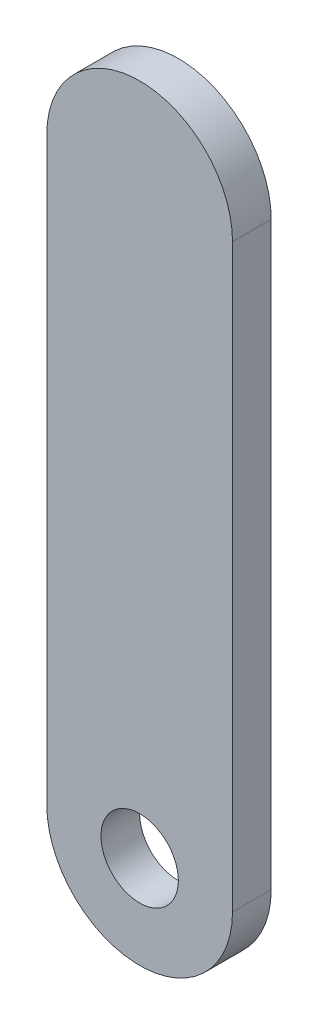
ISO-10303-21;
HEADER;
FILE_DESCRIPTION(('STEP AP214'),'2;1');
FILE_NAME('part.step','',(''),(''),'','','');
FILE_SCHEMA(('AUTOMOTIVE_DESIGN { 1 0 10303 214 1 1 1 1 }'));
ENDSEC;
DATA;
#1=APPLICATION_CONTEXT('core data for automotive mechanical design processes');
#2=APPLICATION_PROTOCOL_DEFINITION('international standard','automotive_design',2000,#1);
#3=PRODUCT_CONTEXT('',#1,'mechanical');
#4=PRODUCT('Part','Part','',(#3));
#5=PRODUCT_RELATED_PRODUCT_CATEGORY('part','',(#4));
#6=PRODUCT_DEFINITION_FORMATION('','',#4);
#7=PRODUCT_DEFINITION_CONTEXT('part definition',#1,'design');
#8=PRODUCT_DEFINITION('design','',#6,#7);
#9=PRODUCT_DEFINITION_SHAPE('','',#8);
#10=(LENGTH_UNIT() NAMED_UNIT(*) SI_UNIT(.MILLI.,.METRE.));
#11=(NAMED_UNIT(*) PLANE_ANGLE_UNIT() SI_UNIT($,.RADIAN.));
#12=(NAMED_UNIT(*) SI_UNIT($,.STERADIAN.) SOLID_ANGLE_UNIT());
#13=UNCERTAINTY_MEASURE_WITH_UNIT(LENGTH_MEASURE(1.E-05),#10,'distance_accuracy_value','');
#14=(GEOMETRIC_REPRESENTATION_CONTEXT(3) GLOBAL_UNCERTAINTY_ASSIGNED_CONTEXT((#13)) GLOBAL_UNIT_ASSIGNED_CONTEXT((#10,
#11,#12)) REPRESENTATION_CONTEXT('',''));
#15=CARTESIAN_POINT('',(0.,0.,0.));
#16=DIRECTION('',(0.,0.,1.));
#17=DIRECTION('',(1.,0.,0.));
#18=AXIS2_PLACEMENT_3D('',#15,#16,#17);
#19=CARTESIAN_POINT('',(0.,0.,5.));
#20=DIRECTION('',(0.,0.,1.));
#21=DIRECTION('',(1.,0.,0.));
#22=AXIS2_PLACEMENT_3D('',#19,#20,#21);
#23=PLANE('',#22);
#24=CARTESIAN_POINT('',(0.,0.,5.));
#25=DIRECTION('',(0.,0.,1.));
#26=DIRECTION('',(1.,0.,0.));
#27=AXIS2_PLACEMENT_3D('',#24,#25,#26);
#28=CIRCLE('',#27,12.);
#29=CARTESIAN_POINT('',(-12.,0.,5.));
#30=VERTEX_POINT('',#29);
#31=CARTESIAN_POINT('',(12.,0.,5.));
#32=VERTEX_POINT('',#31);
#33=EDGE_CURVE('E85',#30,#32,#28,.T.);
#34=ORIENTED_EDGE('',*,*,#33,.T.);
#35=DIRECTION('',(0.,1.,0.));
#36=VECTOR('',#35,1.);
#37=CARTESIAN_POINT('',(12.,0.,5.));
#38=LINE('',#37,#36);
#39=CARTESIAN_POINT('',(12.,75.,5.));
#40=VERTEX_POINT('',#39);
#41=EDGE_CURVE('E80',#32,#40,#38,.T.);
#42=ORIENTED_EDGE('',*,*,#41,.T.);
#43=CARTESIAN_POINT('',(0.,75.,5.));
#44=DIRECTION('',(0.,0.,1.));
#45=DIRECTION('',(1.,0.,0.));
#46=AXIS2_PLACEMENT_3D('',#43,#44,#45);
#47=CIRCLE('',#46,12.);
#48=CARTESIAN_POINT('',(-12.,75.,5.));
#49=VERTEX_POINT('',#48);
#50=EDGE_CURVE('E83',#40,#49,#47,.T.);
#51=ORIENTED_EDGE('',*,*,#50,.T.);
#52=DIRECTION('',(0.,-1.,0.));
#53=VECTOR('',#52,1.);
#54=CARTESIAN_POINT('',(-12.,0.,5.));
#55=LINE('',#54,#53);
#56=EDGE_CURVE('E50',#49,#30,#55,.T.);
#57=ORIENTED_EDGE('',*,*,#56,.T.);
#58=EDGE_LOOP('',(#34,#42,#51,#57));
#59=FACE_BOUND('',#58,.T.);
#60=CARTESIAN_POINT('',(0.,0.,5.));
#61=DIRECTION('',(0.,0.,1.));
#62=DIRECTION('',(1.,0.,0.));
#63=AXIS2_PLACEMENT_3D('',#60,#61,#62);
#64=CIRCLE('',#63,5.);
#65=CARTESIAN_POINT('',(5.,0.,5.));
#66=VERTEX_POINT('',#65);
#67=EDGE_CURVE('E100',#66,#66,#64,.T.);
#68=ORIENTED_EDGE('',*,*,#67,.F.);
#69=EDGE_LOOP('',(#68));
#70=FACE_BOUND('',#69,.T.);
#71=ADVANCED_FACE('F33',(#59,#70),#23,.T.);
#72=CARTESIAN_POINT('',(0.,0.,0.));
#73=DIRECTION('',(0.,0.,1.));
#74=DIRECTION('',(1.,0.,0.));
#75=AXIS2_PLACEMENT_3D('',#72,#73,#74);
#76=PLANE('',#75);
#77=CARTESIAN_POINT('',(0.,0.,0.));
#78=DIRECTION('',(0.,0.,1.));
#79=DIRECTION('',(1.,0.,0.));
#80=AXIS2_PLACEMENT_3D('',#77,#78,#79);
#81=CIRCLE('',#80,12.);
#82=CARTESIAN_POINT('',(-12.,0.,0.));
#83=VERTEX_POINT('',#82);
#84=CARTESIAN_POINT('',(12.,0.,0.));
#85=VERTEX_POINT('',#84);
#86=EDGE_CURVE('E97',#83,#85,#81,.T.);
#87=ORIENTED_EDGE('',*,*,#86,.F.);
#88=DIRECTION('',(0.,-1.,0.));
#89=VECTOR('',#88,1.);
#90=CARTESIAN_POINT('',(-12.,0.,0.));
#91=LINE('',#90,#89);
#92=CARTESIAN_POINT('',(-12.,75.,0.));
#93=VERTEX_POINT('',#92);
#94=EDGE_CURVE('E73',#93,#83,#91,.T.);
#95=ORIENTED_EDGE('',*,*,#94,.F.);
#96=CARTESIAN_POINT('',(0.,75.,0.));
#97=DIRECTION('',(0.,0.,1.));
#98=DIRECTION('',(1.,0.,0.));
#99=AXIS2_PLACEMENT_3D('',#96,#97,#98);
#100=CIRCLE('',#99,12.);
#101=CARTESIAN_POINT('',(12.,75.,0.));
#102=VERTEX_POINT('',#101);
#103=EDGE_CURVE('E67',#102,#93,#100,.T.);
#104=ORIENTED_EDGE('',*,*,#103,.F.);
#105=DIRECTION('',(0.,1.,0.));
#106=VECTOR('',#105,1.);
#107=CARTESIAN_POINT('',(12.,0.,0.));
#108=LINE('',#107,#106);
#109=EDGE_CURVE('E89',#85,#102,#108,.T.);
#110=ORIENTED_EDGE('',*,*,#109,.F.);
#111=EDGE_LOOP('',(#87,#95,#104,#110));
#112=FACE_BOUND('',#111,.T.);
#113=CARTESIAN_POINT('',(0.,0.,0.));
#114=DIRECTION('',(0.,0.,1.));
#115=DIRECTION('',(1.,0.,0.));
#116=AXIS2_PLACEMENT_3D('',#113,#114,#115);
#117=CIRCLE('',#116,5.);
#118=CARTESIAN_POINT('',(5.,0.,0.));
#119=VERTEX_POINT('',#118);
#120=EDGE_CURVE('E112',#119,#119,#117,.T.);
#121=ORIENTED_EDGE('',*,*,#120,.T.);
#122=EDGE_LOOP('',(#121));
#123=FACE_BOUND('',#122,.T.);
#124=ADVANCED_FACE('F108',(#112,#123),#76,.F.);
#125=CARTESIAN_POINT('',(0.,0.,5.));
#126=DIRECTION('',(0.,0.,-1.));
#127=DIRECTION('',(-1.,0.,0.));
#128=AXIS2_PLACEMENT_3D('',#125,#126,#127);
#129=CYLINDRICAL_SURFACE('',#128,12.);
#130=ORIENTED_EDGE('',*,*,#86,.T.);
#131=DIRECTION('',(0.,0.,-1.));
#132=VECTOR('',#131,1.);
#133=CARTESIAN_POINT('',(12.,0.,5.));
#134=LINE('',#133,#132);
#135=EDGE_CURVE('E11',#32,#85,#134,.T.);
#136=ORIENTED_EDGE('',*,*,#135,.F.);
#137=ORIENTED_EDGE('',*,*,#33,.F.);
#138=DIRECTION('',(0.,0.,-1.));
#139=VECTOR('',#138,1.);
#140=CARTESIAN_POINT('',(-12.,0.,5.));
#141=LINE('',#140,#139);
#142=EDGE_CURVE('E93',#30,#83,#141,.T.);
#143=ORIENTED_EDGE('',*,*,#142,.T.);
#144=EDGE_LOOP('',(#130,#136,#137,#143));
#145=FACE_BOUND('',#144,.T.);
#146=ADVANCED_FACE('F35',(#145),#129,.T.);
#147=CARTESIAN_POINT('',(12.,0.,5.));
#148=DIRECTION('',(-1.,0.,0.));
#149=DIRECTION('',(0.,0.,1.));
#150=AXIS2_PLACEMENT_3D('',#147,#148,#149);
#151=PLANE('',#150);
#152=ORIENTED_EDGE('',*,*,#109,.T.);
#153=DIRECTION('',(0.,0.,-1.));
#154=VECTOR('',#153,1.);
#155=CARTESIAN_POINT('',(12.,75.,5.));
#156=LINE('',#155,#154);
#157=EDGE_CURVE('E42',#40,#102,#156,.T.);
#158=ORIENTED_EDGE('',*,*,#157,.F.);
#159=ORIENTED_EDGE('',*,*,#41,.F.);
#160=ORIENTED_EDGE('',*,*,#135,.T.);
#161=EDGE_LOOP('',(#152,#158,#159,#160));
#162=FACE_BOUND('',#161,.T.);
#163=ADVANCED_FACE('F88',(#162),#151,.F.);
#164=CARTESIAN_POINT('',(0.,75.,5.));
#165=DIRECTION('',(0.,0.,-1.));
#166=DIRECTION('',(-1.,0.,0.));
#167=AXIS2_PLACEMENT_3D('',#164,#165,#166);
#168=CYLINDRICAL_SURFACE('',#167,12.);
#169=ORIENTED_EDGE('',*,*,#103,.T.);
#170=DIRECTION('',(0.,0.,-1.));
#171=VECTOR('',#170,1.);
#172=CARTESIAN_POINT('',(-12.,75.,5.));
#173=LINE('',#172,#171);
#174=EDGE_CURVE('E90',#49,#93,#173,.T.);
#175=ORIENTED_EDGE('',*,*,#174,.F.);
#176=ORIENTED_EDGE('',*,*,#50,.F.);
#177=ORIENTED_EDGE('',*,*,#157,.T.);
#178=EDGE_LOOP('',(#169,#175,#176,#177));
#179=FACE_BOUND('',#178,.T.);
#180=ADVANCED_FACE('F91',(#179),#168,.T.);
#181=CARTESIAN_POINT('',(-12.,0.,5.));
#182=DIRECTION('',(1.,0.,0.));
#183=DIRECTION('',(0.,0.,-1.));
#184=AXIS2_PLACEMENT_3D('',#181,#182,#183);
#185=PLANE('',#184);
#186=ORIENTED_EDGE('',*,*,#94,.T.);
#187=ORIENTED_EDGE('',*,*,#142,.F.);
#188=ORIENTED_EDGE('',*,*,#56,.F.);
#189=ORIENTED_EDGE('',*,*,#174,.T.);
#190=EDGE_LOOP('',(#186,#187,#188,#189));
#191=FACE_BOUND('',#190,.T.);
#192=ADVANCED_FACE('F105',(#191),#185,.F.);
#193=CARTESIAN_POINT('',(0.,0.,5.));
#194=DIRECTION('',(0.,0.,-1.));
#195=DIRECTION('',(-1.,0.,0.));
#196=AXIS2_PLACEMENT_3D('',#193,#194,#195);
#197=CYLINDRICAL_SURFACE('',#196,5.);
#198=ORIENTED_EDGE('',*,*,#67,.T.);
#199=EDGE_LOOP('',(#198));
#200=FACE_BOUND('',#199,.T.);
#201=ORIENTED_EDGE('',*,*,#120,.F.);
#202=EDGE_LOOP('',(#201));
#203=FACE_BOUND('',#202,.T.);
#204=ADVANCED_FACE('F118',(#200,#203),#197,.F.);
#205=CLOSED_SHELL('',(#71,#124,#146,#163,#180,#192,#204));
#206=MANIFOLD_SOLID_BREP('B2',#205);
#207=ADVANCED_BREP_SHAPE_REPRESENTATION('',(#18,#206),#14);
#208=SHAPE_DEFINITION_REPRESENTATION(#9,#207);
ENDSEC;
END-ISO-10303-21;
